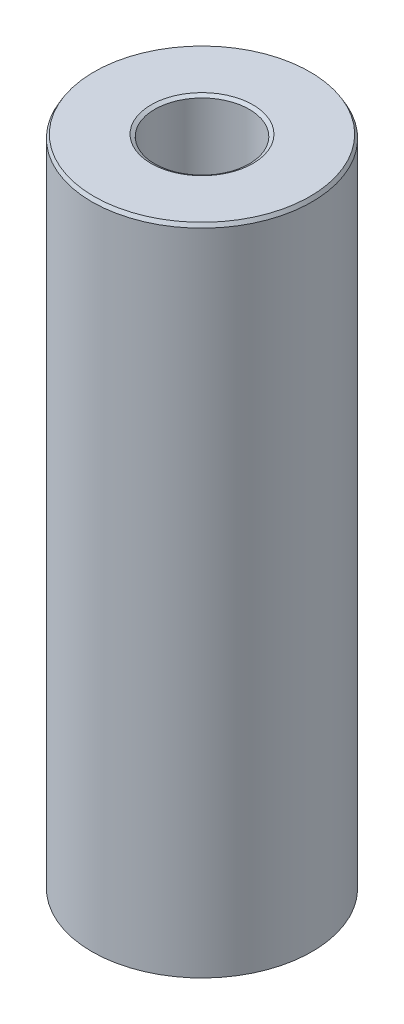
ISO-10303-21;
HEADER;
FILE_DESCRIPTION(('STEP AP214'),'2;1');
FILE_NAME('part.step','',(''),(''),'','','');
FILE_SCHEMA(('AUTOMOTIVE_DESIGN { 1 0 10303 214 1 1 1 1 }'));
ENDSEC;
DATA;
#1=APPLICATION_CONTEXT('core data for automotive mechanical design processes');
#2=APPLICATION_PROTOCOL_DEFINITION('international standard','automotive_design',2000,#1);
#3=PRODUCT_CONTEXT('',#1,'mechanical');
#4=PRODUCT('Part','Part','',(#3));
#5=PRODUCT_RELATED_PRODUCT_CATEGORY('part','',(#4));
#6=PRODUCT_DEFINITION_FORMATION('','',#4);
#7=PRODUCT_DEFINITION_CONTEXT('part definition',#1,'design');
#8=PRODUCT_DEFINITION('design','',#6,#7);
#9=PRODUCT_DEFINITION_SHAPE('','',#8);
#10=(LENGTH_UNIT() NAMED_UNIT(*) SI_UNIT(.MILLI.,.METRE.));
#11=(NAMED_UNIT(*) PLANE_ANGLE_UNIT() SI_UNIT($,.RADIAN.));
#12=(NAMED_UNIT(*) SI_UNIT($,.STERADIAN.) SOLID_ANGLE_UNIT());
#13=UNCERTAINTY_MEASURE_WITH_UNIT(LENGTH_MEASURE(1.E-05),#10,'distance_accuracy_value','');
#14=(GEOMETRIC_REPRESENTATION_CONTEXT(3) GLOBAL_UNCERTAINTY_ASSIGNED_CONTEXT((#13)) GLOBAL_UNIT_ASSIGNED_CONTEXT((#10,
#11,#12)) REPRESENTATION_CONTEXT('',''));
#15=CARTESIAN_POINT('',(0.,0.,0.));
#16=DIRECTION('',(0.,0.,1.));
#17=DIRECTION('',(1.,0.,0.));
#18=AXIS2_PLACEMENT_3D('',#15,#16,#17);
#19=CARTESIAN_POINT('',(0.,312.460441922668,0.));
#20=DIRECTION('',(0.,-1.,0.));
#21=DIRECTION('',(0.,0.,-1.));
#22=AXIS2_PLACEMENT_3D('',#19,#20,#21);
#23=CYLINDRICAL_SURFACE('',#22,52.5);
#24=CARTESIAN_POINT('',(0.,0.998419643419846,0.));
#25=DIRECTION('',(0.,1.,0.));
#26=DIRECTION('',(0.,0.,1.));
#27=AXIS2_PLACEMENT_3D('',#24,#25,#26);
#28=CIRCLE('',#27,52.5);
#29=CARTESIAN_POINT('',(0.,0.998419643419846,52.5));
#30=VERTEX_POINT('',#29);
#31=EDGE_CURVE('E10',#30,#30,#28,.T.);
#32=ORIENTED_EDGE('',*,*,#31,.T.);
#33=EDGE_LOOP('',(#32));
#34=FACE_BOUND('',#33,.T.);
#35=CARTESIAN_POINT('',(0.,310.73112837299,0.));
#36=DIRECTION('',(0.,1.,0.));
#37=DIRECTION('',(0.,0.,1.));
#38=AXIS2_PLACEMENT_3D('',#35,#36,#37);
#39=CIRCLE('',#38,52.5);
#40=CARTESIAN_POINT('',(0.,310.73112837299,52.5));
#41=VERTEX_POINT('',#40);
#42=EDGE_CURVE('E50',#41,#41,#39,.F.);
#43=ORIENTED_EDGE('',*,*,#42,.T.);
#44=EDGE_LOOP('',(#43));
#45=FACE_BOUND('',#44,.T.);
#46=ADVANCED_FACE('F39',(#34,#45),#23,.T.);
#47=CARTESIAN_POINT('',(0.,312.460441922668,0.));
#48=DIRECTION('',(0.,1.,0.));
#49=DIRECTION('',(0.,0.,1.));
#50=AXIS2_PLACEMENT_3D('',#47,#48,#49);
#51=PLANE('',#50);
#52=CARTESIAN_POINT('',(0.,312.460441922668,0.));
#53=DIRECTION('',(0.,1.,0.));
#54=DIRECTION('',(0.,0.,1.));
#55=AXIS2_PLACEMENT_3D('',#52,#53,#54);
#56=CIRCLE('',#55,24.2801282244609);
#57=CARTESIAN_POINT('',(0.,312.460441922668,24.2801282244609));
#58=VERTEX_POINT('',#57);
#59=EDGE_CURVE('E58',#58,#58,#56,.F.);
#60=ORIENTED_EDGE('',*,*,#59,.T.);
#61=EDGE_LOOP('',(#60));
#62=FACE_BOUND('',#61,.T.);
#63=CARTESIAN_POINT('',(0.,312.460441922668,0.));
#64=DIRECTION('',(0.,1.,0.));
#65=DIRECTION('',(0.,0.,1.));
#66=AXIS2_PLACEMENT_3D('',#63,#64,#65);
#67=CIRCLE('',#66,51.50158035658);
#68=CARTESIAN_POINT('',(0.,312.460441922668,51.50158035658));
#69=VERTEX_POINT('',#68);
#70=EDGE_CURVE('E61',#69,#69,#67,.T.);
#71=ORIENTED_EDGE('',*,*,#70,.T.);
#72=EDGE_LOOP('',(#71));
#73=FACE_BOUND('',#72,.T.);
#74=ADVANCED_FACE('F88',(#62,#73),#51,.T.);
#75=CARTESIAN_POINT('',(0.,0.,0.));
#76=DIRECTION('',(0.,1.,0.));
#77=DIRECTION('',(0.,0.,1.));
#78=AXIS2_PLACEMENT_3D('',#75,#76,#77);
#79=PLANE('',#78);
#80=CARTESIAN_POINT('',(0.,0.,0.));
#81=DIRECTION('',(0.,1.,0.));
#82=DIRECTION('',(0.,0.,1.));
#83=AXIS2_PLACEMENT_3D('',#80,#81,#82);
#84=CIRCLE('',#83,23.5492343182027);
#85=CARTESIAN_POINT('',(0.,0.,23.5492343182027));
#86=VERTEX_POINT('',#85);
#87=EDGE_CURVE('E51',#86,#86,#84,.T.);
#88=ORIENTED_EDGE('',*,*,#87,.T.);
#89=EDGE_LOOP('',(#88));
#90=FACE_BOUND('',#89,.T.);
#91=CARTESIAN_POINT('',(0.,0.,0.));
#92=DIRECTION('',(0.,1.,0.));
#93=DIRECTION('',(0.,0.,1.));
#94=AXIS2_PLACEMENT_3D('',#91,#92,#93);
#95=CIRCLE('',#94,50.7706864503219);
#96=CARTESIAN_POINT('',(0.,0.,50.7706864503219));
#97=VERTEX_POINT('',#96);
#98=EDGE_CURVE('E54',#97,#97,#95,.F.);
#99=ORIENTED_EDGE('',*,*,#98,.T.);
#100=EDGE_LOOP('',(#99));
#101=FACE_BOUND('',#100,.T.);
#102=ADVANCED_FACE('F83',(#90,#101),#79,.F.);
#103=CARTESIAN_POINT('',(0.,312.460441922668,0.));
#104=DIRECTION('',(0.,-1.,0.));
#105=DIRECTION('',(0.,0.,-1.));
#106=AXIS2_PLACEMENT_3D('',#103,#104,#105);
#107=CYLINDRICAL_SURFACE('',#106,22.5508146747828);
#108=CARTESIAN_POINT('',(0.,311.462022279249,0.));
#109=DIRECTION('',(0.,1.,0.));
#110=DIRECTION('',(0.,0.,1.));
#111=AXIS2_PLACEMENT_3D('',#108,#109,#110);
#112=CIRCLE('',#111,22.5508146747828);
#113=CARTESIAN_POINT('',(0.,311.462022279249,22.5508146747828));
#114=VERTEX_POINT('',#113);
#115=EDGE_CURVE('E67',#114,#114,#112,.T.);
#116=ORIENTED_EDGE('',*,*,#115,.T.);
#117=EDGE_LOOP('',(#116));
#118=FACE_BOUND('',#117,.T.);
#119=CARTESIAN_POINT('',(0.,1.72931354967809,0.));
#120=DIRECTION('',(0.,1.,0.));
#121=DIRECTION('',(0.,0.,1.));
#122=AXIS2_PLACEMENT_3D('',#119,#120,#121);
#123=CIRCLE('',#122,22.5508146747828);
#124=CARTESIAN_POINT('',(0.,1.72931354967809,22.5508146747828));
#125=VERTEX_POINT('',#124);
#126=EDGE_CURVE('E69',#125,#125,#123,.F.);
#127=ORIENTED_EDGE('',*,*,#126,.T.);
#128=EDGE_LOOP('',(#127));
#129=FACE_BOUND('',#128,.T.);
#130=ADVANCED_FACE('F71',(#118,#129),#107,.F.);
#131=CARTESIAN_POINT('',(0.,311.462022279249,0.));
#132=DIRECTION('',(0.,1.,0.));
#133=DIRECTION('',(0.,0.,1.));
#134=AXIS2_PLACEMENT_3D('',#131,#132,#133);
#135=CONICAL_SURFACE('',#134,22.5508146747828,1.04719755119662);
#136=ORIENTED_EDGE('',*,*,#59,.F.);
#137=EDGE_LOOP('',(#136));
#138=FACE_BOUND('',#137,.T.);
#139=ORIENTED_EDGE('',*,*,#115,.F.);
#140=EDGE_LOOP('',(#139));
#141=FACE_BOUND('',#140,.T.);
#142=ADVANCED_FACE('F77',(#138,#141),#135,.F.);
#143=CARTESIAN_POINT('',(0.,0.,0.));
#144=DIRECTION('',(0.,-1.,0.));
#145=DIRECTION('',(0.,0.,-1.));
#146=AXIS2_PLACEMENT_3D('',#143,#144,#145);
#147=CONICAL_SURFACE('',#146,23.5492343182027,0.523598775598295);
#148=ORIENTED_EDGE('',*,*,#126,.F.);
#149=EDGE_LOOP('',(#148));
#150=FACE_BOUND('',#149,.T.);
#151=ORIENTED_EDGE('',*,*,#87,.F.);
#152=EDGE_LOOP('',(#151));
#153=FACE_BOUND('',#152,.T.);
#154=ADVANCED_FACE('F73',(#150,#153),#147,.F.);
#155=CARTESIAN_POINT('',(0.,0.998419643419846,0.));
#156=DIRECTION('',(0.,1.,0.));
#157=DIRECTION('',(0.,0.,1.));
#158=AXIS2_PLACEMENT_3D('',#155,#156,#157);
#159=CONICAL_SURFACE('',#158,52.5,1.04719755119662);
#160=ORIENTED_EDGE('',*,*,#98,.F.);
#161=EDGE_LOOP('',(#160));
#162=FACE_BOUND('',#161,.T.);
#163=ORIENTED_EDGE('',*,*,#31,.F.);
#164=EDGE_LOOP('',(#163));
#165=FACE_BOUND('',#164,.T.);
#166=ADVANCED_FACE('F76',(#162,#165),#159,.T.);
#167=CARTESIAN_POINT('',(0.,312.460441922668,0.));
#168=DIRECTION('',(0.,-1.,0.));
#169=DIRECTION('',(0.,0.,-1.));
#170=AXIS2_PLACEMENT_3D('',#167,#168,#169);
#171=CONICAL_SURFACE('',#170,51.50158035658,0.523598775598291);
#172=ORIENTED_EDGE('',*,*,#42,.F.);
#173=EDGE_LOOP('',(#172));
#174=FACE_BOUND('',#173,.T.);
#175=ORIENTED_EDGE('',*,*,#70,.F.);
#176=EDGE_LOOP('',(#175));
#177=FACE_BOUND('',#176,.T.);
#178=ADVANCED_FACE('F45',(#174,#177),#171,.T.);
#179=CLOSED_SHELL('',(#46,#74,#102,#130,#142,#154,#166,#178));
#180=MANIFOLD_SOLID_BREP('B2',#179);
#181=ADVANCED_BREP_SHAPE_REPRESENTATION('',(#18,#180),#14);
#182=SHAPE_DEFINITION_REPRESENTATION(#9,#181);
ENDSEC;
END-ISO-10303-21;
